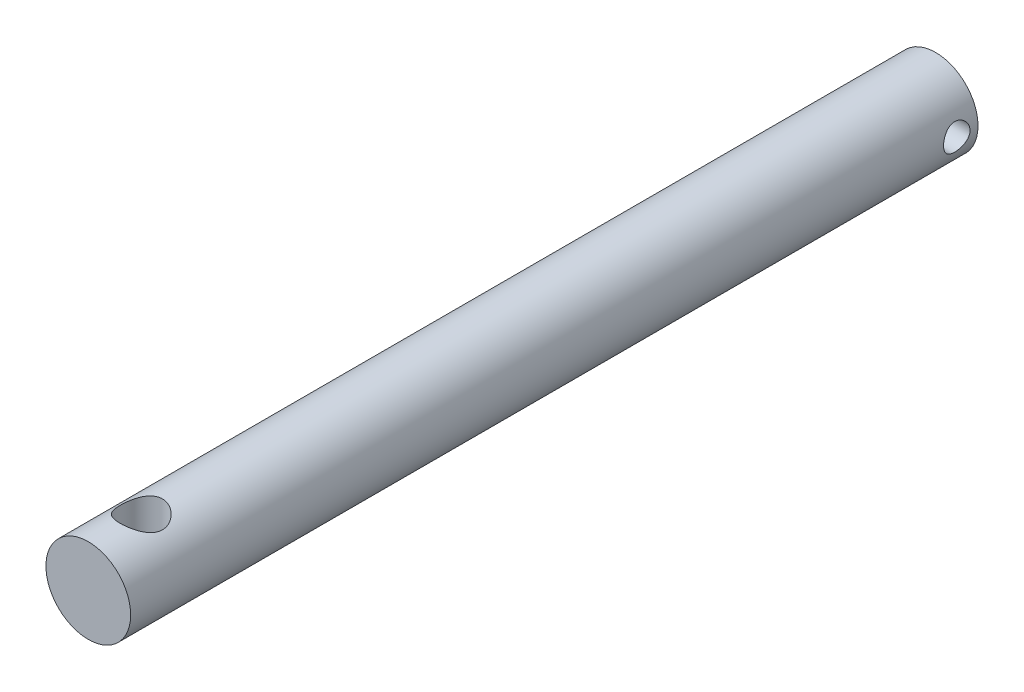
ISO-10303-21;
HEADER;
FILE_DESCRIPTION(('STEP AP214'),'2;1');
FILE_NAME('part.step','',(''),(''),'','','');
FILE_SCHEMA(('AUTOMOTIVE_DESIGN { 1 0 10303 214 1 1 1 1 }'));
ENDSEC;
DATA;
#1=APPLICATION_CONTEXT('core data for automotive mechanical design processes');
#2=APPLICATION_PROTOCOL_DEFINITION('international standard','automotive_design',2000,#1);
#3=PRODUCT_CONTEXT('',#1,'mechanical');
#4=PRODUCT('Part','Part','',(#3));
#5=PRODUCT_RELATED_PRODUCT_CATEGORY('part','',(#4));
#6=PRODUCT_DEFINITION_FORMATION('','',#4);
#7=PRODUCT_DEFINITION_CONTEXT('part definition',#1,'design');
#8=PRODUCT_DEFINITION('design','',#6,#7);
#9=PRODUCT_DEFINITION_SHAPE('','',#8);
#10=(LENGTH_UNIT() NAMED_UNIT(*) SI_UNIT(.MILLI.,.METRE.));
#11=(NAMED_UNIT(*) PLANE_ANGLE_UNIT() SI_UNIT($,.RADIAN.));
#12=(NAMED_UNIT(*) SI_UNIT($,.STERADIAN.) SOLID_ANGLE_UNIT());
#13=UNCERTAINTY_MEASURE_WITH_UNIT(LENGTH_MEASURE(1.E-05),#10,'distance_accuracy_value','');
#14=(GEOMETRIC_REPRESENTATION_CONTEXT(3) GLOBAL_UNCERTAINTY_ASSIGNED_CONTEXT((#13)) GLOBAL_UNIT_ASSIGNED_CONTEXT((#10,
#11,#12)) REPRESENTATION_CONTEXT('',''));
#15=CARTESIAN_POINT('',(0.,0.,0.));
#16=DIRECTION('',(0.,0.,1.));
#17=DIRECTION('',(1.,0.,0.));
#18=AXIS2_PLACEMENT_3D('',#15,#16,#17);
#19=CARTESIAN_POINT('',(0.,0.,160.));
#20=DIRECTION('',(0.,0.,-1.));
#21=DIRECTION('',(-1.,0.,0.));
#22=AXIS2_PLACEMENT_3D('',#19,#20,#21);
#23=CYLINDRICAL_SURFACE('',#22,8.);
#24=CARTESIAN_POINT('',(0.,0.,0.));
#25=DIRECTION('',(0.,0.,1.));
#26=DIRECTION('',(1.,0.,0.));
#27=AXIS2_PLACEMENT_3D('',#24,#25,#26);
#28=CIRCLE('',#27,8.);
#29=CARTESIAN_POINT('',(8.,0.,0.));
#30=VERTEX_POINT('',#29);
#31=EDGE_CURVE('E46',#30,#30,#28,.T.);
#32=ORIENTED_EDGE('',*,*,#31,.T.);
#33=EDGE_LOOP('',(#32));
#34=FACE_BOUND('',#33,.T.);
#35=CARTESIAN_POINT('',(0.,0.,160.));
#36=DIRECTION('',(0.,0.,1.));
#37=DIRECTION('',(1.,0.,0.));
#38=AXIS2_PLACEMENT_3D('',#35,#36,#37);
#39=CIRCLE('',#38,8.);
#40=CARTESIAN_POINT('',(8.,0.,160.));
#41=VERTEX_POINT('',#40);
#42=EDGE_CURVE('E10',#41,#41,#39,.T.);
#43=ORIENTED_EDGE('',*,*,#42,.F.);
#44=EDGE_LOOP('',(#43));
#45=FACE_BOUND('',#44,.T.);
#46=CARTESIAN_POINT('',(0.,8.,154.));
#47=CARTESIAN_POINT('',(-0.105191216468488,7.99999964432188,153.999999595152));
#48=CARTESIAN_POINT('',(-0.210389995368427,7.99792027620652,153.995845542685));
#49=CARTESIAN_POINT('',(-0.420011249701337,7.98965597150982,153.979277921901));
#50=CARTESIAN_POINT('',(-0.524433367425621,7.98346924887743,153.96686076043));
#51=CARTESIAN_POINT('',(-0.731828138370608,7.96713597659603,153.933886485305));
#52=CARTESIAN_POINT('',(-0.834798506711921,7.95698378017499,153.913317763343));
#53=CARTESIAN_POINT('',(-1.0384152051955,7.93298382243633,153.864282792444));
#54=CARTESIAN_POINT('',(-1.13906056699381,7.91913455043164,153.835813314936));
#55=CARTESIAN_POINT('',(-1.43561775388138,7.87265974292142,153.739251768882));
#56=CARTESIAN_POINT('',(-1.62719620658471,7.83501976471674,153.659837019153));
#57=CARTESIAN_POINT('',(-1.99392146995423,7.74982886318844,153.473710958912));
#58=CARTESIAN_POINT('',(-2.16906957469775,7.70227872135526,153.367001800619));
#59=CARTESIAN_POINT('',(-2.51002321260363,7.59825056785885,153.121930177401));
#60=CARTESIAN_POINT('',(-2.67462250306453,7.54140647262265,152.982043311806));
#61=CARTESIAN_POINT('',(-2.97911611963432,7.42640030348014,152.677924862414));
#62=CARTESIAN_POINT('',(-3.11899161990725,7.36823726296469,152.513674900957));
#63=CARTESIAN_POINT('',(-3.38102385527716,7.25195135134797,152.15002101287));
#64=CARTESIAN_POINT('',(-3.50096528772937,7.19418138823906,151.948878695725));
#65=CARTESIAN_POINT('',(-3.65378721735265,7.11709930290977,151.632065460046));
#66=CARTESIAN_POINT('',(-3.70022392693972,7.09299422837206,151.523905337193));
#67=CARTESIAN_POINT('',(-3.78359067078057,7.04887690211805,151.303199028921));
#68=CARTESIAN_POINT('',(-3.82052633371566,7.02886222858683,151.190655486078));
#69=CARTESIAN_POINT('',(-3.88251046204455,6.9948044998643,150.968805780694));
#70=CARTESIAN_POINT('',(-3.9081340887804,6.9804776446802,150.859703580835));
#71=CARTESIAN_POINT('',(-3.95018060072942,6.95677065788593,150.63925947718));
#72=CARTESIAN_POINT('',(-3.96660836750271,6.9473879018896,150.527918794247));
#73=CARTESIAN_POINT('',(-3.99001913809429,6.93396933490057,150.303993906534));
#74=CARTESIAN_POINT('',(-3.99700782997253,6.92993030376772,150.191410491912));
#75=CARTESIAN_POINT('',(-4.00144340059851,6.92737022415464,149.965999521961));
#76=CARTESIAN_POINT('',(-3.99889118971828,6.92884864921081,149.853171990953));
#77=CARTESIAN_POINT('',(-3.98516575152016,6.93675038555111,149.641835621554));
#78=CARTESIAN_POINT('',(-3.97506329407581,6.94255931040712,149.543232560428));
#79=CARTESIAN_POINT('',(-3.94763759493625,6.95818925294571,149.347348387834));
#80=CARTESIAN_POINT('',(-3.9303120853467,6.96801153072176,149.25006770148));
#81=CARTESIAN_POINT('',(-3.86777248849785,7.00304835203764,148.9612208671));
#82=CARTESIAN_POINT('',(-3.8119855502641,7.03383903740602,148.772504542919));
#83=CARTESIAN_POINT('',(-3.6728359957252,7.10749917506982,148.403053667229));
#84=CARTESIAN_POINT('',(-3.58886132884633,7.15063327143764,148.222607424652));
#85=CARTESIAN_POINT('',(-3.39616568981264,7.2441365265382,147.877469812985));
#86=CARTESIAN_POINT('',(-3.28743360222608,7.29450893132236,147.712785567935));
#87=CARTESIAN_POINT('',(-3.03227252755196,7.40452458073482,147.381917118295));
#88=CARTESIAN_POINT('',(-2.88281182497071,7.46453347888883,147.218190429292));
#89=CARTESIAN_POINT('',(-2.55818830727484,7.58191186589975,146.9170403935));
#90=CARTESIAN_POINT('',(-2.38301327894515,7.63928008344307,146.779629617525));
#91=CARTESIAN_POINT('',(-2.09944472683199,7.72027607686169,146.593246969786));
#92=CARTESIAN_POINT('',(-1.9989679987013,7.74696304862188,146.533318240247));
#93=CARTESIAN_POINT('',(-1.79256850112002,7.79730441532266,146.422233521223));
#94=CARTESIAN_POINT('',(-1.68664805204876,7.82096008757468,146.371073833602));
#95=CARTESIAN_POINT('',(-1.47010242051538,7.86454042959534,146.278080877627));
#96=CARTESIAN_POINT('',(-1.35947915341347,7.88446660078232,146.236243854867));
#97=CARTESIAN_POINT('',(-1.13432950721216,7.91999221203723,146.162380061448));
#98=CARTESIAN_POINT('',(-1.01980357880327,7.9355921498224,146.130352162241));
#99=CARTESIAN_POINT('',(-0.797438403015323,7.96087677585623,146.078773152145));
#100=CARTESIAN_POINT('',(-0.689830906854559,7.9709443603734,146.058408402943));
#101=CARTESIAN_POINT('',(-0.472998720376374,7.98674429615844,146.026553551757));
#102=CARTESIAN_POINT('',(-0.363774173887717,7.99247703065614,146.015062665263));
#103=CARTESIAN_POINT('',(-0.144648447401168,7.99944300548302,146.001109528455));
#104=CARTESIAN_POINT('',(-0.0347475425961411,8.00067796839692,145.998643821621));
#105=CARTESIAN_POINT('',(0.184837638972488,7.99861804620746,146.00276424211));
#106=CARTESIAN_POINT('',(0.294521925108022,7.99532336157662,146.009349968837));
#107=CARTESIAN_POINT('',(0.504259611746536,7.98472734940324,146.030623569527));
#108=CARTESIAN_POINT('',(0.604398259266981,7.97775776257091,146.044641069104));
#109=CARTESIAN_POINT('',(0.803035609307663,7.96021983565123,146.080136399664));
#110=CARTESIAN_POINT('',(0.90153374307058,7.94965027363514,146.101616763793));
#111=CARTESIAN_POINT('',(1.19351737727532,7.91289127905722,146.1769351736));
#112=CARTESIAN_POINT('',(1.38368108667204,7.88164133135127,146.241670140591));
#113=CARTESIAN_POINT('',(1.75558493783057,7.80736894774679,146.399998108906));
#114=CARTESIAN_POINT('',(1.93692876519228,7.76403545540106,146.494363309172));
#115=CARTESIAN_POINT('',(2.28183826656571,7.66975878800211,146.70843103426));
#116=CARTESIAN_POINT('',(2.44539632212196,7.61881237399843,146.828144352632));
#117=CARTESIAN_POINT('',(2.76706877708067,7.50833088367007,147.103033119703));
#118=CARTESIAN_POINT('',(2.92307134240143,7.44844369061623,147.260536537259));
#119=CARTESIAN_POINT('',(3.20744226426285,7.33048735856255,147.599735565255));
#120=CARTESIAN_POINT('',(3.33579150415336,7.27241950081065,147.781447771603));
#121=CARTESIAN_POINT('',(3.50772930633183,7.19028164087441,148.073994014422));
#122=CARTESIAN_POINT('',(3.5626157867948,7.16316684054652,148.177483758436));
#123=CARTESIAN_POINT('',(3.66334616154282,7.11217812644117,148.389518435316));
#124=CARTESIAN_POINT('',(3.70919441458266,7.08830265221424,148.498060900095));
#125=CARTESIAN_POINT('',(3.79131200961919,7.04472262103751,148.719421645364));
#126=CARTESIAN_POINT('',(3.82758904080803,7.02501471854545,148.832236409795));
#127=CARTESIAN_POINT('',(3.89012004539429,6.99058253819989,149.061352789072));
#128=CARTESIAN_POINT('',(3.91637557070639,6.9758574887497,149.177653861022));
#129=CARTESIAN_POINT('',(3.95643062416587,6.9532102561999,149.401412133163));
#130=CARTESIAN_POINT('',(3.97118378192521,6.94477079792059,149.508646832908));
#131=CARTESIAN_POINT('',(3.99195118317072,6.93285441469714,149.724227670201));
#132=CARTESIAN_POINT('',(3.99796634225491,6.92937696981658,149.832573690101));
#133=CARTESIAN_POINT('',(4.00116308319383,6.92753208063798,150.04940749673));
#134=CARTESIAN_POINT('',(3.99834777004019,6.92916284018069,150.157895220223));
#135=CARTESIAN_POINT('',(3.98394653809982,6.9374509348198,150.374061147114));
#136=CARTESIAN_POINT('',(3.97236097836303,6.94410806413885,150.481739383469));
#137=CARTESIAN_POINT('',(3.92770249100378,6.9695287958286,150.781800137041));
#138=CARTESIAN_POINT('',(3.88483285002043,6.99372760142387,150.972365867314));
#139=CARTESIAN_POINT('',(3.77270184038046,7.05483682415845,151.343268502553));
#140=CARTESIAN_POINT('',(3.70343198216888,7.09175132993569,151.523602095704));
#141=CARTESIAN_POINT('',(3.53526338936953,7.17714225279385,151.882488553514));
#142=CARTESIAN_POINT('',(3.43468670285354,7.22622883383996,152.060107775762));
#143=CARTESIAN_POINT('',(3.20860173383708,7.3294133274236,152.397101978277));
#144=CARTESIAN_POINT('',(3.08308048046464,7.38351383930109,152.556467398541));
#145=CARTESIAN_POINT('',(2.79282250805389,7.49849148240842,152.872562909038));
#146=CARTESIAN_POINT('',(2.62517402605099,7.55939328373464,153.026619929624));
#147=CARTESIAN_POINT('',(2.26458287075638,7.67511613929542,153.305068422813));
#148=CARTESIAN_POINT('',(2.0716266499056,7.72993390744395,153.429443905242));
#149=CARTESIAN_POINT('',(1.76603106757847,7.80335210517359,153.590904249415));
#150=CARTESIAN_POINT('',(1.66100410373828,7.82643367929071,153.640693641409));
#151=CARTESIAN_POINT('',(1.44639623629744,7.8689179624278,153.731148947001));
#152=CARTESIAN_POINT('',(1.33681760142932,7.88832247803741,153.771819342698));
#153=CARTESIAN_POINT('',(1.11415600876093,7.92283587265691,153.843476344434));
#154=CARTESIAN_POINT('',(1.00108129646084,7.93795411409434,153.874484071387));
#155=CARTESIAN_POINT('',(0.772189766950839,7.96347694583625,153.926510080016));
#156=CARTESIAN_POINT('',(0.65637467030461,7.97388441530453,153.947534463772));
#157=CARTESIAN_POINT('',(0.450433316283297,7.98781110043795,153.975579621199));
#158=CARTESIAN_POINT('',(0.360660623567805,7.99237392421377,153.984729389176));
#159=CARTESIAN_POINT('',(0.180593821057083,7.99846856848792,153.996939836378));
#160=CARTESIAN_POINT('',(0.0902996969389638,8.00000030532612,154.000000347535));
#161=CARTESIAN_POINT('',(0.,8.,154.));
#162=B_SPLINE_CURVE_WITH_KNOTS('',3,(#46,#47,#48,#49,#50,#51,#52,#53,#54,#55,#56,#57,#58,#59,
#60,#61,#62,#63,#64,#65,#66,#67,#68,#69,#70,#71,#72,#73,#74,#75,#76,#77,#78,#79,#80,#81,#82,#83,
#84,#85,#86,#87,#88,#89,#90,#91,#92,#93,#94,#95,#96,#97,#98,#99,#100,#101,#102,#103,#104,#105,
#106,#107,#108,#109,#110,#111,#112,#113,#114,#115,#116,#117,#118,#119,#120,#121,#122,#123,#124,
#125,#126,#127,#128,#129,#130,#131,#132,#133,#134,#135,#136,#137,#138,#139,#140,#141,#142,#143,
#144,#145,#146,#147,#148,#149,#150,#151,#152,#153,#154,#155,#156,#157,#158,#159,#160,#161),
.UNSPECIFIED.,.T.,.F.,(4,2,2,2,2,2,2,2,2,2,2,2,2,2,2,2,2,2,2,2,2,2,2,2,2,2,2,2,2,2,2,2,2,2,2,2,
2,2,2,2,2,2,2,2,2,2,2,2,2,2,2,2,2,2,2,2,2,4),(0.,0.315484235719913,0.631105747230255,
0.947178346952281,1.26338029745355,1.89263632058596,2.52184274094304,3.18911473348914,
3.8568926492329,4.57645675584686,4.93648208726458,5.29629363598335,5.63476191634053,
5.97305035229577,6.31113484191768,6.64918707308226,6.94669148652863,7.24428938086225,
7.83905304157542,8.44767049128776,9.05656173495715,9.74265853790342,10.4290822684957,
10.7886699173095,11.1481055433964,11.5073961555811,11.8666454155399,12.1961419049363,
12.5256092612256,12.8549504227676,13.184277008843,13.4879760335491,13.791778244799,
14.3988188497914,15.0232162256701,15.6478800144877,16.33388641032,17.0203655291613,
17.380682030865,17.7408243397693,18.1006764355618,18.4604727825931,18.7857371805984,
19.1109674938045,19.4360834615764,19.7611861199665,20.3488209353336,20.9366448769134,
21.5639619965908,22.1916061711246,22.8955134356509,23.5997990605888,23.9548906509477,
24.309807324981,24.6639426811876,25.0178613011449,25.2886761616556,25.5594984967416),.UNSPECIFIED.);
#163=CARTESIAN_POINT('',(0.,8.,154.));
#164=VERTEX_POINT('',#163);
#165=EDGE_CURVE('E56',#164,#164,#162,.T.);
#166=ORIENTED_EDGE('',*,*,#165,.T.);
#167=EDGE_LOOP('',(#166));
#168=FACE_BOUND('',#167,.T.);
#169=CARTESIAN_POINT('',(0.,-8.,154.));
#170=CARTESIAN_POINT('',(0.105191216468488,-7.99999964432188,153.999999595152));
#171=CARTESIAN_POINT('',(0.210389995368427,-7.99792027620652,153.995845542685));
#172=CARTESIAN_POINT('',(0.420011249701337,-7.98965597150982,153.979277921901));
#173=CARTESIAN_POINT('',(0.524433367425621,-7.98346924887743,153.96686076043));
#174=CARTESIAN_POINT('',(0.731828138370608,-7.96713597659603,153.933886485305));
#175=CARTESIAN_POINT('',(0.834798506711921,-7.95698378017499,153.913317763343));
#176=CARTESIAN_POINT('',(1.0384152051955,-7.93298382243633,153.864282792444));
#177=CARTESIAN_POINT('',(1.13906056699381,-7.91913455043164,153.835813314936));
#178=CARTESIAN_POINT('',(1.43561775388138,-7.87265974292142,153.739251768882));
#179=CARTESIAN_POINT('',(1.62719620658471,-7.83501976471674,153.659837019153));
#180=CARTESIAN_POINT('',(1.99392146995423,-7.74982886318844,153.473710958912));
#181=CARTESIAN_POINT('',(2.16906957469775,-7.70227872135526,153.367001800619));
#182=CARTESIAN_POINT('',(2.51002321260363,-7.59825056785885,153.121930177401));
#183=CARTESIAN_POINT('',(2.67462250306453,-7.54140647262265,152.982043311806));
#184=CARTESIAN_POINT('',(2.97911611963432,-7.42640030348014,152.677924862414));
#185=CARTESIAN_POINT('',(3.11899161990725,-7.36823726296469,152.513674900957));
#186=CARTESIAN_POINT('',(3.38102385527716,-7.25195135134797,152.15002101287));
#187=CARTESIAN_POINT('',(3.50096528772937,-7.19418138823906,151.948878695725));
#188=CARTESIAN_POINT('',(3.65378721735265,-7.11709930290977,151.632065460046));
#189=CARTESIAN_POINT('',(3.70022392693972,-7.09299422837206,151.523905337193));
#190=CARTESIAN_POINT('',(3.78359067078057,-7.04887690211805,151.303199028921));
#191=CARTESIAN_POINT('',(3.82052633371566,-7.02886222858683,151.190655486078));
#192=CARTESIAN_POINT('',(3.88251046204455,-6.9948044998643,150.968805780694));
#193=CARTESIAN_POINT('',(3.9081340887804,-6.9804776446802,150.859703580835));
#194=CARTESIAN_POINT('',(3.95018060072942,-6.95677065788593,150.63925947718));
#195=CARTESIAN_POINT('',(3.96660836750271,-6.9473879018896,150.527918794247));
#196=CARTESIAN_POINT('',(3.99001913809429,-6.93396933490057,150.303993906534));
#197=CARTESIAN_POINT('',(3.99700782997253,-6.92993030376772,150.191410491912));
#198=CARTESIAN_POINT('',(4.00144340059851,-6.92737022415464,149.965999521961));
#199=CARTESIAN_POINT('',(3.99889118971828,-6.92884864921081,149.853171990953));
#200=CARTESIAN_POINT('',(3.98516575152016,-6.93675038555111,149.641835621554));
#201=CARTESIAN_POINT('',(3.97506329407581,-6.94255931040712,149.543232560428));
#202=CARTESIAN_POINT('',(3.94763759493625,-6.95818925294571,149.347348387834));
#203=CARTESIAN_POINT('',(3.9303120853467,-6.96801153072176,149.25006770148));
#204=CARTESIAN_POINT('',(3.86777248849785,-7.00304835203764,148.9612208671));
#205=CARTESIAN_POINT('',(3.8119855502641,-7.03383903740602,148.772504542919));
#206=CARTESIAN_POINT('',(3.6728359957252,-7.10749917506982,148.403053667229));
#207=CARTESIAN_POINT('',(3.58886132884633,-7.15063327143764,148.222607424652));
#208=CARTESIAN_POINT('',(3.39616568981264,-7.2441365265382,147.877469812985));
#209=CARTESIAN_POINT('',(3.28743360222608,-7.29450893132236,147.712785567935));
#210=CARTESIAN_POINT('',(3.03227252755196,-7.40452458073482,147.381917118295));
#211=CARTESIAN_POINT('',(2.88281182497071,-7.46453347888883,147.218190429292));
#212=CARTESIAN_POINT('',(2.55818830727484,-7.58191186589975,146.9170403935));
#213=CARTESIAN_POINT('',(2.38301327894515,-7.63928008344307,146.779629617525));
#214=CARTESIAN_POINT('',(2.09944472683199,-7.72027607686169,146.593246969786));
#215=CARTESIAN_POINT('',(1.9989679987013,-7.74696304862188,146.533318240247));
#216=CARTESIAN_POINT('',(1.79256850112002,-7.79730441532266,146.422233521223));
#217=CARTESIAN_POINT('',(1.68664805204876,-7.82096008757468,146.371073833602));
#218=CARTESIAN_POINT('',(1.47010242051538,-7.86454042959534,146.278080877627));
#219=CARTESIAN_POINT('',(1.35947915341347,-7.88446660078232,146.236243854867));
#220=CARTESIAN_POINT('',(1.13432950721216,-7.91999221203723,146.162380061448));
#221=CARTESIAN_POINT('',(1.01980357880327,-7.9355921498224,146.130352162241));
#222=CARTESIAN_POINT('',(0.797438403015323,-7.96087677585623,146.078773152145));
#223=CARTESIAN_POINT('',(0.689830906854559,-7.9709443603734,146.058408402943));
#224=CARTESIAN_POINT('',(0.472998720376374,-7.98674429615844,146.026553551757));
#225=CARTESIAN_POINT('',(0.363774173887717,-7.99247703065614,146.015062665263));
#226=CARTESIAN_POINT('',(0.144648447401168,-7.99944300548302,146.001109528455));
#227=CARTESIAN_POINT('',(0.0347475425961411,-8.00067796839692,145.998643821621));
#228=CARTESIAN_POINT('',(-0.184837638972488,-7.99861804620746,146.00276424211));
#229=CARTESIAN_POINT('',(-0.294521925108022,-7.99532336157662,146.009349968837));
#230=CARTESIAN_POINT('',(-0.504259611746536,-7.98472734940324,146.030623569527));
#231=CARTESIAN_POINT('',(-0.604398259266981,-7.97775776257091,146.044641069104));
#232=CARTESIAN_POINT('',(-0.803035609307663,-7.96021983565123,146.080136399664));
#233=CARTESIAN_POINT('',(-0.90153374307058,-7.94965027363514,146.101616763793));
#234=CARTESIAN_POINT('',(-1.19351737727532,-7.91289127905722,146.1769351736));
#235=CARTESIAN_POINT('',(-1.38368108667204,-7.88164133135127,146.241670140591));
#236=CARTESIAN_POINT('',(-1.75558493783057,-7.80736894774679,146.399998108906));
#237=CARTESIAN_POINT('',(-1.93692876519228,-7.76403545540106,146.494363309172));
#238=CARTESIAN_POINT('',(-2.28183826656571,-7.66975878800211,146.70843103426));
#239=CARTESIAN_POINT('',(-2.44539632212196,-7.61881237399843,146.828144352632));
#240=CARTESIAN_POINT('',(-2.76706877708067,-7.50833088367007,147.103033119703));
#241=CARTESIAN_POINT('',(-2.92307134240143,-7.44844369061623,147.260536537259));
#242=CARTESIAN_POINT('',(-3.20744226426285,-7.33048735856255,147.599735565255));
#243=CARTESIAN_POINT('',(-3.33579150415336,-7.27241950081065,147.781447771603));
#244=CARTESIAN_POINT('',(-3.50772930633183,-7.19028164087441,148.073994014422));
#245=CARTESIAN_POINT('',(-3.5626157867948,-7.16316684054652,148.177483758436));
#246=CARTESIAN_POINT('',(-3.66334616154282,-7.11217812644117,148.389518435316));
#247=CARTESIAN_POINT('',(-3.70919441458266,-7.08830265221424,148.498060900095));
#248=CARTESIAN_POINT('',(-3.79131200961919,-7.04472262103751,148.719421645364));
#249=CARTESIAN_POINT('',(-3.82758904080803,-7.02501471854545,148.832236409795));
#250=CARTESIAN_POINT('',(-3.89012004539429,-6.99058253819989,149.061352789072));
#251=CARTESIAN_POINT('',(-3.91637557070639,-6.9758574887497,149.177653861022));
#252=CARTESIAN_POINT('',(-3.95643062416587,-6.9532102561999,149.401412133163));
#253=CARTESIAN_POINT('',(-3.97118378192521,-6.94477079792059,149.508646832908));
#254=CARTESIAN_POINT('',(-3.99195118317072,-6.93285441469714,149.724227670201));
#255=CARTESIAN_POINT('',(-3.99796634225491,-6.92937696981658,149.832573690101));
#256=CARTESIAN_POINT('',(-4.00116308319383,-6.92753208063798,150.04940749673));
#257=CARTESIAN_POINT('',(-3.99834777004019,-6.92916284018069,150.157895220223));
#258=CARTESIAN_POINT('',(-3.98394653809982,-6.9374509348198,150.374061147114));
#259=CARTESIAN_POINT('',(-3.97236097836303,-6.94410806413885,150.481739383469));
#260=CARTESIAN_POINT('',(-3.92770249100378,-6.9695287958286,150.781800137041));
#261=CARTESIAN_POINT('',(-3.88483285002043,-6.99372760142387,150.972365867314));
#262=CARTESIAN_POINT('',(-3.77270184038046,-7.05483682415845,151.343268502553));
#263=CARTESIAN_POINT('',(-3.70343198216888,-7.09175132993569,151.523602095704));
#264=CARTESIAN_POINT('',(-3.53526338936953,-7.17714225279385,151.882488553514));
#265=CARTESIAN_POINT('',(-3.43468670285354,-7.22622883383996,152.060107775762));
#266=CARTESIAN_POINT('',(-3.20860173383708,-7.3294133274236,152.397101978277));
#267=CARTESIAN_POINT('',(-3.08308048046464,-7.38351383930109,152.556467398541));
#268=CARTESIAN_POINT('',(-2.79282250805389,-7.49849148240842,152.872562909038));
#269=CARTESIAN_POINT('',(-2.62517402605099,-7.55939328373464,153.026619929624));
#270=CARTESIAN_POINT('',(-2.26458287075638,-7.67511613929542,153.305068422813));
#271=CARTESIAN_POINT('',(-2.0716266499056,-7.72993390744395,153.429443905242));
#272=CARTESIAN_POINT('',(-1.76603106757847,-7.80335210517359,153.590904249415));
#273=CARTESIAN_POINT('',(-1.66100410373828,-7.82643367929071,153.640693641409));
#274=CARTESIAN_POINT('',(-1.44639623629744,-7.8689179624278,153.731148947001));
#275=CARTESIAN_POINT('',(-1.33681760142932,-7.88832247803741,153.771819342698));
#276=CARTESIAN_POINT('',(-1.11415600876093,-7.92283587265691,153.843476344434));
#277=CARTESIAN_POINT('',(-1.00108129646084,-7.93795411409434,153.874484071387));
#278=CARTESIAN_POINT('',(-0.772189766950839,-7.96347694583625,153.926510080016));
#279=CARTESIAN_POINT('',(-0.65637467030461,-7.97388441530453,153.947534463772));
#280=CARTESIAN_POINT('',(-0.450433316283297,-7.98781110043795,153.975579621199));
#281=CARTESIAN_POINT('',(-0.360660623567805,-7.99237392421377,153.984729389176));
#282=CARTESIAN_POINT('',(-0.180593821057083,-7.99846856848792,153.996939836378));
#283=CARTESIAN_POINT('',(-0.0902996969389638,-8.00000030532612,154.000000347535));
#284=CARTESIAN_POINT('',(0.,-8.,154.));
#285=B_SPLINE_CURVE_WITH_KNOTS('',3,(#169,#170,#171,#172,#173,#174,#175,#176,#177,#178,#179,
#180,#181,#182,#183,#184,#185,#186,#187,#188,#189,#190,#191,#192,#193,#194,#195,#196,#197,#198,
#199,#200,#201,#202,#203,#204,#205,#206,#207,#208,#209,#210,#211,#212,#213,#214,#215,#216,#217,
#218,#219,#220,#221,#222,#223,#224,#225,#226,#227,#228,#229,#230,#231,#232,#233,#234,#235,#236,
#237,#238,#239,#240,#241,#242,#243,#244,#245,#246,#247,#248,#249,#250,#251,#252,#253,#254,#255,
#256,#257,#258,#259,#260,#261,#262,#263,#264,#265,#266,#267,#268,#269,#270,#271,#272,#273,#274,
#275,#276,#277,#278,#279,#280,#281,#282,#283,#284),.UNSPECIFIED.,.T.,.F.,(4,2,2,2,2,2,2,2,2,2,2,
2,2,2,2,2,2,2,2,2,2,2,2,2,2,2,2,2,2,2,2,2,2,2,2,2,2,2,2,2,2,2,2,2,2,2,2,2,2,2,2,2,2,2,2,2,2,4),
(0.,0.315484235719913,0.631105747230255,0.947178346952281,1.26338029745355,1.89263632058596,
2.52184274094304,3.18911473348914,3.8568926492329,4.57645675584686,4.93648208726458,
5.29629363598335,5.63476191634053,5.97305035229577,6.31113484191768,6.64918707308226,
6.94669148652863,7.24428938086225,7.83905304157542,8.44767049128776,9.05656173495715,
9.74265853790342,10.4290822684957,10.7886699173095,11.1481055433964,11.5073961555811,
11.8666454155399,12.1961419049363,12.5256092612256,12.8549504227676,13.184277008843,
13.4879760335491,13.791778244799,14.3988188497914,15.0232162256701,15.6478800144877,
16.33388641032,17.0203655291613,17.380682030865,17.7408243397693,18.1006764355618,
18.4604727825931,18.7857371805984,19.1109674938045,19.4360834615764,19.7611861199665,
20.3488209353336,20.9366448769134,21.5639619965908,22.1916061711246,22.8955134356509,
23.5997990605888,23.9548906509477,24.309807324981,24.6639426811876,25.0178613011449,
25.2886761616556,25.5594984967416),.UNSPECIFIED.);
#286=CARTESIAN_POINT('',(0.,-8.,154.));
#287=VERTEX_POINT('',#286);
#288=EDGE_CURVE('E51',#287,#287,#285,.T.);
#289=ORIENTED_EDGE('',*,*,#288,.T.);
#290=EDGE_LOOP('',(#289));
#291=FACE_BOUND('',#290,.T.);
#292=CARTESIAN_POINT('',(8.,0.,6.5));
#293=CARTESIAN_POINT('',(7.9999993175598,-0.136878370349093,6.49999910682485));
#294=CARTESIAN_POINT('',(7.99645389969682,-0.273766105005719,6.48872154611109));
#295=CARTESIAN_POINT('',(7.98265788177613,-0.543538419176897,6.44402751692153));
#296=CARTESIAN_POINT('',(7.97240576399719,-0.676422085451815,6.41060603727128));
#297=CARTESIAN_POINT('',(7.94631631395819,-0.934257087301613,6.32286125760852));
#298=CARTESIAN_POINT('',(7.9304876299805,-1.05922035397161,6.26857031069407));
#299=CARTESIAN_POINT('',(7.89487938322185,-1.29826960469292,6.14076536464334));
#300=CARTESIAN_POINT('',(7.8750991979981,-1.41235387088977,6.06724833643883));
#301=CARTESIAN_POINT('',(7.83300427480565,-1.62993066990456,5.90068801596528));
#302=CARTESIAN_POINT('',(7.81063431853978,-1.73304005631332,5.80715822987786));
#303=CARTESIAN_POINT('',(7.76620092748417,-1.92239476407399,5.6042632151729));
#304=CARTESIAN_POINT('',(7.74413755046914,-2.00863694579739,5.4948950450109));
#305=CARTESIAN_POINT('',(7.70222289396344,-2.16388672966227,5.26011087238383));
#306=CARTESIAN_POINT('',(7.68243976603591,-2.23241568300258,5.13436504494556));
#307=CARTESIAN_POINT('',(7.64815603598469,-2.34719482153343,4.87241537003625));
#308=CARTESIAN_POINT('',(7.63365404257377,-2.39345087543889,4.73621428841214));
#309=CARTESIAN_POINT('',(7.61215213969001,-2.46096919860067,4.46154384509588));
#310=CARTESIAN_POINT('',(7.60493945859016,-2.48294220015729,4.32326631272229));
#311=CARTESIAN_POINT('',(7.59820110281901,-2.50349110073976,4.04481376217621));
#312=CARTESIAN_POINT('',(7.59867338454668,-2.50207321991544,3.90463925835668));
#313=CARTESIAN_POINT('',(7.60706378150876,-2.47643649465478,3.63225107946203));
#314=CARTESIAN_POINT('',(7.61468683491897,-2.45312115738766,3.49994174827687));
#315=CARTESIAN_POINT('',(7.63604051304978,-2.38581626711252,3.24121568692531));
#316=CARTESIAN_POINT('',(7.6497717868623,-2.34182451689101,3.1147995845824));
#317=CARTESIAN_POINT('',(7.68202088028593,-2.23377749362554,2.86929611113473));
#318=CARTESIAN_POINT('',(7.70060569321649,-2.16943851324164,2.75034277861603));
#319=CARTESIAN_POINT('',(7.7404371316014,-2.02272041475696,2.52462446424175));
#320=CARTESIAN_POINT('',(7.76168444789102,-1.94033661043155,2.41786265949258));
#321=CARTESIAN_POINT('',(7.80563055600986,-1.75543390836425,2.21445011316602));
#322=CARTESIAN_POINT('',(7.82835139211391,-1.65216914118563,2.11848088444063));
#323=CARTESIAN_POINT('',(7.87183141519161,-1.43072881619106,1.94505621284064));
#324=CARTESIAN_POINT('',(7.89259045676745,-1.31255215469804,1.86760214156158));
#325=CARTESIAN_POINT('',(7.93002589780382,-1.06332922093091,1.73294462279745));
#326=CARTESIAN_POINT('',(7.94666921296415,-0.932189813838559,1.67590372907206));
#327=CARTESIAN_POINT('',(7.97375911657108,-0.661535955565288,1.58489399829687));
#328=CARTESIAN_POINT('',(7.98420758650304,-0.522024061449217,1.55091815552321));
#329=CARTESIAN_POINT('',(7.99742778790027,-0.24437031458069,1.50816391484204));
#330=CARTESIAN_POINT('',(8.00048045790873,-0.106383697577687,1.49846291281295));
#331=CARTESIAN_POINT('',(7.99939599461967,0.169260611465171,1.50193245327466));
#332=CARTESIAN_POINT('',(7.9952599116227,0.306918348613017,1.51509965464522));
#333=CARTESIAN_POINT('',(7.98044727539523,0.574438665951697,1.56319118521277));
#334=CARTESIAN_POINT('',(7.96993586221374,0.704409956841872,1.59756653522497));
#335=CARTESIAN_POINT('',(7.94360242758579,0.956703857722752,1.68642870473343));
#336=CARTESIAN_POINT('',(7.92777975028687,1.07902552089812,1.74091800805002));
#337=CARTESIAN_POINT('',(7.89197085518848,1.31586481334438,1.86994643309737));
#338=CARTESIAN_POINT('',(7.87189253635335,1.43011947957558,1.94494197499362));
#339=CARTESIAN_POINT('',(7.82986820006859,1.64473170192052,2.11230642023485));
#340=CARTESIAN_POINT('',(7.80792167695774,1.7450854760879,2.20468003548928));
#341=CARTESIAN_POINT('',(7.76353989766283,1.93317492583804,2.4085177801042));
#342=CARTESIAN_POINT('',(7.74111973412883,2.02025304679062,2.52059332747845));
#343=CARTESIAN_POINT('',(7.69923894191212,2.17442500490303,2.75825323275355));
#344=CARTESIAN_POINT('',(7.67977826622621,2.24151915946859,2.88383737605397));
#345=CARTESIAN_POINT('',(7.64623564661738,2.35340166961084,3.14469034574095));
#346=CARTESIAN_POINT('',(7.63213292713749,2.39827639112025,3.27991929887144));
#347=CARTESIAN_POINT('',(7.6110234168862,2.4644578863618,3.55654498649724));
#348=CARTESIAN_POINT('',(7.60401392602456,2.48577362827989,3.69793935268706));
#349=CARTESIAN_POINT('',(7.59816585427753,2.50358812316251,3.97600817516085));
#350=CARTESIAN_POINT('',(7.59897209200284,2.50116559243271,4.11260690769484));
#351=CARTESIAN_POINT('',(7.60780180751807,2.47417636257668,4.38334916988388));
#352=CARTESIAN_POINT('',(7.61582494863208,2.44961069645024,4.51749281377347));
#353=CARTESIAN_POINT('',(7.6379362836678,2.37975459827235,4.77758807918378));
#354=CARTESIAN_POINT('',(7.65193396380514,2.33477284812016,4.90363088218672));
#355=CARTESIAN_POINT('',(7.68439408509128,2.22560454669999,5.14648082706801));
#356=CARTESIAN_POINT('',(7.70285743429343,2.16141408888473,5.26328608415681));
#357=CARTESIAN_POINT('',(7.74306974067005,2.01271350026986,5.48929194087963));
#358=CARTESIAN_POINT('',(7.76491897845913,1.92750667048264,5.59801625900048));
#359=CARTESIAN_POINT('',(7.8089799764242,1.7404179928096,5.799972656224));
#360=CARTESIAN_POINT('',(7.83119183213309,1.63853168468878,5.89320057798212));
#361=CARTESIAN_POINT('',(7.87434543904947,1.41697332564669,6.06456507672586));
#362=CARTESIAN_POINT('',(7.89522203461345,1.29682914897477,6.1421094728999));
#363=CARTESIAN_POINT('',(7.93253538593756,1.0445582760273,6.27579783027891));
#364=CARTESIAN_POINT('',(7.94897388631644,0.912436315590896,6.33195020428367));
#365=CARTESIAN_POINT('',(7.97441301466941,0.651495270747956,6.41718273521693));
#366=CARTESIAN_POINT('',(7.98392481612283,0.523340674225092,6.44814973461067));
#367=CARTESIAN_POINT('',(7.99671800680967,0.263459790880494,6.48955671993543));
#368=CARTESIAN_POINT('',(8.00000065679286,0.131734232279349,6.50000085960801));
#369=CARTESIAN_POINT('',(8.,0.,6.5));
#370=B_SPLINE_CURVE_WITH_KNOTS('',3,(#292,#293,#294,#295,#296,#297,#298,#299,#300,#301,#302,
#303,#304,#305,#306,#307,#308,#309,#310,#311,#312,#313,#314,#315,#316,#317,#318,#319,#320,#321,
#322,#323,#324,#325,#326,#327,#328,#329,#330,#331,#332,#333,#334,#335,#336,#337,#338,#339,#340,
#341,#342,#343,#344,#345,#346,#347,#348,#349,#350,#351,#352,#353,#354,#355,#356,#357,#358,#359,
#360,#361,#362,#363,#364,#365,#366,#367,#368,#369),.UNSPECIFIED.,.T.,.F.,(4,2,2,2,2,2,2,2,2,2,2,
2,2,2,2,2,2,2,2,2,2,2,2,2,2,2,2,2,2,2,2,2,2,2,2,2,2,2,4),(0.,0.41015089886502,0.820394646698133,
1.23000495840487,1.63967984311678,2.06075644390317,2.48191134862552,2.91347542494988,
3.34492572559054,3.7633830033442,4.18172900590276,4.58353834844338,4.98539039958126,
5.3931128544109,5.80094132020717,6.227334945592,6.65376014826606,7.0835092137954,
7.51312768989108,7.92615137096475,8.33911471298725,8.74181253445744,9.14456010068999,
9.55712649476686,9.96980491418519,10.3988355742628,10.8278594196742,11.2552023150671,
11.6823824779468,12.0902440696666,12.4980866352126,12.8999582681244,13.3019116867944,
13.7195902803182,14.1373807476578,14.5688133627192,15.0000761335177,15.3948927332218,
15.7896294154519),.UNSPECIFIED.);
#371=CARTESIAN_POINT('',(8.,0.,6.5));
#372=VERTEX_POINT('',#371);
#373=EDGE_CURVE('E39',#372,#372,#370,.T.);
#374=ORIENTED_EDGE('',*,*,#373,.F.);
#375=EDGE_LOOP('',(#374));
#376=FACE_BOUND('',#375,.T.);
#377=ADVANCED_FACE('F35',(#34,#45,#168,#291,#376),#23,.T.);
#378=CARTESIAN_POINT('',(0.,0.,160.));
#379=DIRECTION('',(0.,0.,1.));
#380=DIRECTION('',(1.,0.,0.));
#381=AXIS2_PLACEMENT_3D('',#378,#379,#380);
#382=PLANE('',#381);
#383=ORIENTED_EDGE('',*,*,#42,.T.);
#384=EDGE_LOOP('',(#383));
#385=FACE_BOUND('',#384,.T.);
#386=ADVANCED_FACE('F72',(#385),#382,.T.);
#387=CARTESIAN_POINT('',(0.,0.,0.));
#388=DIRECTION('',(0.,0.,1.));
#389=DIRECTION('',(1.,0.,0.));
#390=AXIS2_PLACEMENT_3D('',#387,#388,#389);
#391=PLANE('',#390);
#392=ORIENTED_EDGE('',*,*,#31,.F.);
#393=EDGE_LOOP('',(#392));
#394=FACE_BOUND('',#393,.T.);
#395=ADVANCED_FACE('F68',(#394),#391,.F.);
#396=CARTESIAN_POINT('',(0.,-10.,150.));
#397=DIRECTION('',(0.,1.,0.));
#398=DIRECTION('',(0.,0.,1.));
#399=AXIS2_PLACEMENT_3D('',#396,#397,#398);
#400=CYLINDRICAL_SURFACE('',#399,4.00000000000001);
#401=ORIENTED_EDGE('',*,*,#165,.F.);
#402=EDGE_LOOP('',(#401));
#403=FACE_BOUND('',#402,.T.);
#404=ORIENTED_EDGE('',*,*,#288,.F.);
#405=EDGE_LOOP('',(#404));
#406=FACE_BOUND('',#405,.T.);
#407=ADVANCED_FACE('F63',(#403,#406),#400,.F.);
#408=CARTESIAN_POINT('',(10.,0.,4.));
#409=DIRECTION('',(-1.,0.,0.));
#410=DIRECTION('',(0.,0.,1.));
#411=AXIS2_PLACEMENT_3D('',#408,#409,#410);
#412=CYLINDRICAL_SURFACE('',#411,2.5);
#413=CARTESIAN_POINT('',(0.,0.,4.));
#414=DIRECTION('',(1.,0.,0.));
#415=DIRECTION('',(0.,0.,-1.));
#416=AXIS2_PLACEMENT_3D('',#413,#414,#415);
#417=CIRCLE('',#416,2.5);
#418=CARTESIAN_POINT('',(0.,0.,1.5));
#419=VERTEX_POINT('',#418);
#420=EDGE_CURVE('E54',#419,#419,#417,.T.);
#421=ORIENTED_EDGE('',*,*,#420,.F.);
#422=EDGE_LOOP('',(#421));
#423=FACE_BOUND('',#422,.T.);
#424=ORIENTED_EDGE('',*,*,#373,.T.);
#425=EDGE_LOOP('',(#424));
#426=FACE_BOUND('',#425,.T.);
#427=ADVANCED_FACE('F67',(#423,#426),#412,.F.);
#428=CARTESIAN_POINT('',(0.,0.,4.));
#429=DIRECTION('',(1.,0.,0.));
#430=DIRECTION('',(0.,0.,-1.));
#431=AXIS2_PLACEMENT_3D('',#428,#429,#430);
#432=PLANE('',#431);
#433=ORIENTED_EDGE('',*,*,#420,.T.);
#434=EDGE_LOOP('',(#433));
#435=FACE_BOUND('',#434,.T.);
#436=ADVANCED_FACE('F97',(#435),#432,.T.);
#437=CLOSED_SHELL('',(#377,#386,#395,#407,#427,#436));
#438=MANIFOLD_SOLID_BREP('B2',#437);
#439=ADVANCED_BREP_SHAPE_REPRESENTATION('',(#18,#438),#14);
#440=SHAPE_DEFINITION_REPRESENTATION(#9,#439);
ENDSEC;
END-ISO-10303-21;
